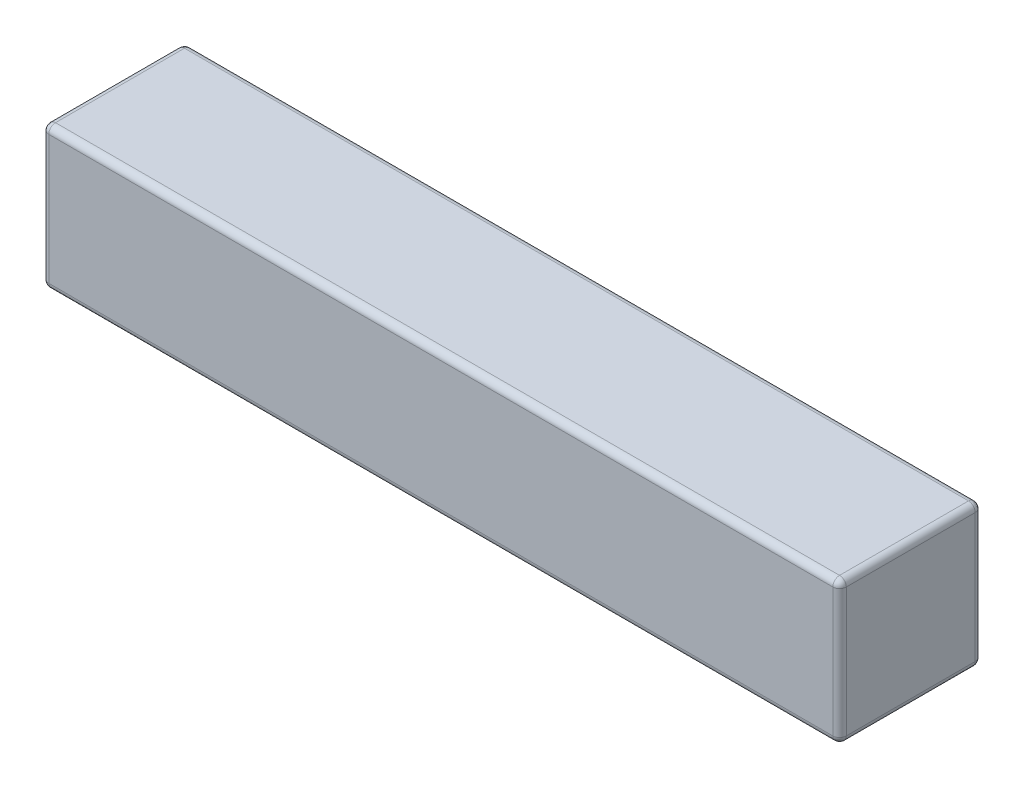
ISO-10303-21;
HEADER;
FILE_DESCRIPTION(('STEP AP214'),'2;1');
FILE_NAME('part.step','',(''),(''),'','','');
FILE_SCHEMA(('AUTOMOTIVE_DESIGN { 1 0 10303 214 1 1 1 1 }'));
ENDSEC;
DATA;
#1=APPLICATION_CONTEXT('core data for automotive mechanical design processes');
#2=APPLICATION_PROTOCOL_DEFINITION('international standard','automotive_design',2000,#1);
#3=PRODUCT_CONTEXT('',#1,'mechanical');
#4=PRODUCT('Part','Part','',(#3));
#5=PRODUCT_RELATED_PRODUCT_CATEGORY('part','',(#4));
#6=PRODUCT_DEFINITION_FORMATION('','',#4);
#7=PRODUCT_DEFINITION_CONTEXT('part definition',#1,'design');
#8=PRODUCT_DEFINITION('design','',#6,#7);
#9=PRODUCT_DEFINITION_SHAPE('','',#8);
#10=(LENGTH_UNIT() NAMED_UNIT(*) SI_UNIT(.MILLI.,.METRE.));
#11=(NAMED_UNIT(*) PLANE_ANGLE_UNIT() SI_UNIT($,.RADIAN.));
#12=(NAMED_UNIT(*) SI_UNIT($,.STERADIAN.) SOLID_ANGLE_UNIT());
#13=UNCERTAINTY_MEASURE_WITH_UNIT(LENGTH_MEASURE(1.E-05),#10,'distance_accuracy_value','');
#14=(GEOMETRIC_REPRESENTATION_CONTEXT(3) GLOBAL_UNCERTAINTY_ASSIGNED_CONTEXT((#13)) GLOBAL_UNIT_ASSIGNED_CONTEXT((#10,
#11,#12)) REPRESENTATION_CONTEXT('',''));
#15=CARTESIAN_POINT('',(0.,0.,0.));
#16=DIRECTION('',(0.,0.,1.));
#17=DIRECTION('',(1.,0.,0.));
#18=AXIS2_PLACEMENT_3D('',#15,#16,#17);
#19=CARTESIAN_POINT('',(13.8499999987,-3.1750000002794,-0.37923963141));
#20=CARTESIAN_POINT('',(13.8499999987,-3.1750000002794,-0.0792396314111998));
#21=CARTESIAN_POINT('',(13.8499999987,-2.8750000002806,-0.0792396314111998));
#22=CARTESIAN_POINT('',(13.8499999987,-2.8750000002806,-0.37923963141));
#23=(BOUNDED_CURVE() B_SPLINE_CURVE(3,(#19,#20,#21,#22),.UNSPECIFIED.,.F.,
.F.) B_SPLINE_CURVE_WITH_KNOTS((4,4),(0.,1.),
.UNSPECIFIED.) CURVE() GEOMETRIC_REPRESENTATION_ITEM() RATIONAL_B_SPLINE_CURVE((1.,
0.333333333333333,0.333333333333333,1.)) REPRESENTATION_ITEM(''));
#24=CARTESIAN_POINT('',(13.8499999987,-3.02500000028,-0.37923963141));
#25=DIRECTION('',(0.,1.,0.));
#26=AXIS1_PLACEMENT('',#24,#25);
#27=SURFACE_OF_REVOLUTION('',#23,#26);
#28=CARTESIAN_POINT('',(13.85000000124,-3.02500000028,-0.37923963141));
#29=DIRECTION('',(-1.,0.,0.));
#30=DIRECTION('',(0.,-1.,0.));
#31=AXIS2_PLACEMENT_3D('',#28,#29,#30);
#32=CIRCLE('',#31,0.149999999719999);
#33=CARTESIAN_POINT('',(13.8499999996525,-3.02500000028,-0.229239631460499));
#34=VERTEX_POINT('',#33);
#35=CARTESIAN_POINT('',(13.8499999996525,-3.17500000009938,-0.3792396314735));
#36=VERTEX_POINT('',#35);
#37=EDGE_CURVE('E316',#34,#36,#32,.F.);
#38=ORIENTED_EDGE('',*,*,#37,.T.);
#39=CARTESIAN_POINT('',(13.8499999987,-3.02500000028,-0.379239631664));
#40=DIRECTION('',(0.,0.,1.));
#41=DIRECTION('',(0.,-1.,0.));
#42=AXIS2_PLACEMENT_3D('',#39,#40,#41);
#43=CIRCLE('',#42,0.149999999719999);
#44=CARTESIAN_POINT('',(13.9999999990277,-3.02500000028,-0.37923963163225));
#45=VERTEX_POINT('',#44);
#46=EDGE_CURVE('E373',#36,#45,#43,.T.);
#47=ORIENTED_EDGE('',*,*,#46,.T.);
#48=CARTESIAN_POINT('',(13.8499999987,-3.02500000028,-0.37923963141));
#49=DIRECTION('',(0.,1.,0.));
#50=DIRECTION('',(0.,0.,1.));
#51=AXIS2_PLACEMENT_3D('',#48,#49,#50);
#52=CIRCLE('',#51,0.1500000000756);
#53=EDGE_CURVE('E141',#45,#34,#52,.F.);
#54=ORIENTED_EDGE('',*,*,#53,.T.);
#55=EDGE_LOOP('',(#38,#47,#54));
#56=FACE_BOUND('',#55,.T.);
#57=ADVANCED_FACE('F17',(#56),#27,.T.);
#58=CARTESIAN_POINT('',(13.8499999987,-3.1750000002794,-3.2542396307));
#59=CARTESIAN_POINT('',(14.1499999986988,-3.1750000002794,-3.2542396307));
#60=CARTESIAN_POINT('',(14.1499999986988,-2.8750000002806,-3.2542396307));
#61=CARTESIAN_POINT('',(13.8499999987,-2.8750000002806,-3.2542396307));
#62=(BOUNDED_CURVE() B_SPLINE_CURVE(3,(#58,#59,#60,#61),.UNSPECIFIED.,.F.,
.F.) B_SPLINE_CURVE_WITH_KNOTS((4,4),(0.,1.),
.UNSPECIFIED.) CURVE() GEOMETRIC_REPRESENTATION_ITEM() RATIONAL_B_SPLINE_CURVE((1.,
0.333333333333333,0.333333333333333,1.)) REPRESENTATION_ITEM(''));
#63=CARTESIAN_POINT('',(13.8499999987,-3.02500000028,-3.2542396307));
#64=DIRECTION('',(0.,1.,0.));
#65=AXIS1_PLACEMENT('',#63,#64);
#66=SURFACE_OF_REVOLUTION('',#62,#65);
#67=CARTESIAN_POINT('',(13.8499999987,-3.02500000028,-3.2542396307));
#68=DIRECTION('',(1.,0.,0.));
#69=DIRECTION('',(0.,-1.,0.));
#70=AXIS2_PLACEMENT_3D('',#67,#68,#69);
#71=CIRCLE('',#70,0.149999999719999);
#72=CARTESIAN_POINT('',(13.8499999990175,-3.17500000009938,-3.2542396307));
#73=VERTEX_POINT('',#72);
#74=CARTESIAN_POINT('',(13.8499999987,-3.02500000028,-3.40423963101479));
#75=VERTEX_POINT('',#74);
#76=EDGE_CURVE('E378',#73,#75,#71,.T.);
#77=ORIENTED_EDGE('',*,*,#76,.T.);
#78=CARTESIAN_POINT('',(13.8499999987,-3.02500000028,-3.2542396307));
#79=DIRECTION('',(0.,1.,0.));
#80=DIRECTION('',(1.,0.,0.));
#81=AXIS2_PLACEMENT_3D('',#78,#79,#80);
#82=CIRCLE('',#81,0.15000000226);
#83=CARTESIAN_POINT('',(13.9999999991674,-3.02500000028,-3.2542396307));
#84=VERTEX_POINT('',#83);
#85=EDGE_CURVE('E383',#75,#84,#82,.F.);
#86=ORIENTED_EDGE('',*,*,#85,.T.);
#87=CARTESIAN_POINT('',(13.8499999987,-3.02500000028,-3.2542396307));
#88=DIRECTION('',(0.,0.,1.));
#89=DIRECTION('',(0.,-1.,0.));
#90=AXIS2_PLACEMENT_3D('',#87,#88,#89);
#91=CIRCLE('',#90,0.149999999719999);
#92=EDGE_CURVE('E371',#84,#73,#91,.F.);
#93=ORIENTED_EDGE('',*,*,#92,.T.);
#94=EDGE_LOOP('',(#77,#86,#93));
#95=FACE_BOUND('',#94,.T.);
#96=ADVANCED_FACE('F166',(#95),#66,.T.);
#97=CARTESIAN_POINT('',(13.9999999986994,-0.1499999999994,-3.2542396307));
#98=CARTESIAN_POINT('',(13.9999999986994,0.149999999999398,-3.2542396307));
#99=CARTESIAN_POINT('',(13.6999999987006,0.149999999999398,-3.2542396307));
#100=CARTESIAN_POINT('',(13.6999999987006,-0.1499999999994,-3.2542396307));
#101=(BOUNDED_CURVE() B_SPLINE_CURVE(3,(#97,#98,#99,#100),.UNSPECIFIED.,.F.,
.F.) B_SPLINE_CURVE_WITH_KNOTS((4,4),(0.,1.),
.UNSPECIFIED.) CURVE() GEOMETRIC_REPRESENTATION_ITEM() RATIONAL_B_SPLINE_CURVE((1.,
0.333333333333333,0.333333333333333,1.)) REPRESENTATION_ITEM(''));
#102=CARTESIAN_POINT('',(13.8499999987,-0.1499999999994,-3.2542396307));
#103=DIRECTION('',(-1.,0.,0.));
#104=AXIS1_PLACEMENT('',#102,#103);
#105=SURFACE_OF_REVOLUTION('',#101,#104);
#106=CARTESIAN_POINT('',(13.8499999987,-0.1499999996184,-3.2542396307));
#107=DIRECTION('',(0.,1.,0.));
#108=DIRECTION('',(1.,0.,0.));
#109=AXIS2_PLACEMENT_3D('',#106,#107,#108);
#110=CIRCLE('',#109,0.15000000226);
#111=CARTESIAN_POINT('',(13.9999999999923,-0.14999999971365,-3.2542396307));
#112=VERTEX_POINT('',#111);
#113=CARTESIAN_POINT('',(13.8499999990175,-0.1499999998089,-3.40423963136722));
#114=VERTEX_POINT('',#113);
#115=EDGE_CURVE('E381',#112,#114,#110,.T.);
#116=ORIENTED_EDGE('',*,*,#115,.T.);
#117=CARTESIAN_POINT('',(13.85000000124,-0.1499999999994,-3.2542396307));
#118=DIRECTION('',(-1.,0.,0.));
#119=DIRECTION('',(0.,1.,0.));
#120=AXIS2_PLACEMENT_3D('',#117,#118,#119);
#121=CIRCLE('',#120,0.1499999999994);
#122=CARTESIAN_POINT('',(13.8499999996525,0.,-3.2542396307));
#123=VERTEX_POINT('',#122);
#124=EDGE_CURVE('E389',#114,#123,#121,.F.);
#125=ORIENTED_EDGE('',*,*,#124,.T.);
#126=CARTESIAN_POINT('',(13.8499999987,-0.1499999999994,-3.2542396307));
#127=DIRECTION('',(0.,0.,-1.));
#128=DIRECTION('',(0.,1.,0.));
#129=AXIS2_PLACEMENT_3D('',#126,#127,#128);
#130=CIRCLE('',#129,0.1499999999994);
#131=EDGE_CURVE('E137',#123,#112,#130,.T.);
#132=ORIENTED_EDGE('',*,*,#131,.T.);
#133=EDGE_LOOP('',(#116,#125,#132));
#134=FACE_BOUND('',#133,.T.);
#135=ADVANCED_FACE('F164',(#134),#105,.T.);
#136=CARTESIAN_POINT('',(14.,0.,0.));
#137=DIRECTION('',(1.,0.,0.));
#138=DIRECTION('',(0.,0.,-1.));
#139=AXIS2_PLACEMENT_3D('',#136,#137,#138);
#140=PLANE('',#139);
#141=DIRECTION('',(0.,1.,0.));
#142=VECTOR('',#141,1.);
#143=CARTESIAN_POINT('',(14.00000000096,-1.5874999999492,-3.2542396307));
#144=LINE('',#143,#142);
#145=EDGE_CURVE('E136',#84,#112,#144,.T.);
#146=ORIENTED_EDGE('',*,*,#145,.T.);
#147=DIRECTION('',(0.,0.,1.));
#148=VECTOR('',#147,1.);
#149=CARTESIAN_POINT('',(13.9999999986994,-0.1499999996184,-1.816739631055));
#150=LINE('',#149,#148);
#151=CARTESIAN_POINT('',(13.9999999990627,-0.149999999666025,-0.3792396316005));
#152=VERTEX_POINT('',#151);
#153=EDGE_CURVE('E127',#112,#152,#150,.T.);
#154=ORIENTED_EDGE('',*,*,#153,.T.);
#155=DIRECTION('',(0.,-1.,0.));
#156=VECTOR('',#155,1.);
#157=CARTESIAN_POINT('',(13.9999999987756,-1.5874999999492,-0.379239631664001));
#158=LINE('',#157,#156);
#159=EDGE_CURVE('E106',#152,#45,#158,.T.);
#160=ORIENTED_EDGE('',*,*,#159,.T.);
#161=DIRECTION('',(0.,0.,-1.));
#162=VECTOR('',#161,1.);
#163=CARTESIAN_POINT('',(13.99999999842,-3.02500000028,-1.816739631182));
#164=LINE('',#163,#162);
#165=EDGE_CURVE('E367',#45,#84,#164,.T.);
#166=ORIENTED_EDGE('',*,*,#165,.T.);
#167=EDGE_LOOP('',(#146,#154,#160,#166));
#168=FACE_BOUND('',#167,.T.);
#169=ADVANCED_FACE('F134',(#168),#140,.T.);
#170=CARTESIAN_POINT('',(13.8499999987,-0.1499999999994,-0.2292396314106));
#171=CARTESIAN_POINT('',(13.8499999987,0.1499999999994,-0.2292396314106));
#172=CARTESIAN_POINT('',(13.8499999987,0.1499999999994,-0.5292396314094));
#173=CARTESIAN_POINT('',(13.8499999987,-0.1499999999994,-0.5292396314094));
#174=(BOUNDED_CURVE() B_SPLINE_CURVE(3,(#170,#171,#172,#173),.UNSPECIFIED.,.F.,
.F.) B_SPLINE_CURVE_WITH_KNOTS((4,4),(0.,1.),
.UNSPECIFIED.) CURVE() GEOMETRIC_REPRESENTATION_ITEM() RATIONAL_B_SPLINE_CURVE((1.,
0.333333333333333,0.333333333333333,1.)) REPRESENTATION_ITEM(''));
#175=CARTESIAN_POINT('',(13.8499999987,-0.1499999999994,-0.37923963141));
#176=DIRECTION('',(0.,0.,-1.));
#177=AXIS1_PLACEMENT('',#175,#176);
#178=SURFACE_OF_REVOLUTION('',#174,#177);
#179=CARTESIAN_POINT('',(13.8499999987,-0.1499999996184,-0.37923963141));
#180=DIRECTION('',(0.,1.,0.));
#181=DIRECTION('',(0.,0.,1.));
#182=AXIS2_PLACEMENT_3D('',#179,#180,#181);
#183=CIRCLE('',#182,0.1500000000756);
#184=CARTESIAN_POINT('',(13.8499999996525,-0.1499999998089,-0.229239631390649));
#185=VERTEX_POINT('',#184);
#186=EDGE_CURVE('E111',#185,#152,#183,.T.);
#187=ORIENTED_EDGE('',*,*,#186,.T.);
#188=CARTESIAN_POINT('',(13.8499999987,-0.1499999999994,-0.37923963141));
#189=DIRECTION('',(0.,0.,-1.));
#190=DIRECTION('',(0.,1.,0.));
#191=AXIS2_PLACEMENT_3D('',#188,#189,#190);
#192=CIRCLE('',#191,0.1499999999994);
#193=CARTESIAN_POINT('',(13.8499999996525,0.,-0.37923963144175));
#194=VERTEX_POINT('',#193);
#195=EDGE_CURVE('E114',#152,#194,#192,.F.);
#196=ORIENTED_EDGE('',*,*,#195,.T.);
#197=CARTESIAN_POINT('',(13.85000000124,-0.1499999999994,-0.37923963141));
#198=DIRECTION('',(1.,0.,0.));
#199=DIRECTION('',(0.,1.,0.));
#200=AXIS2_PLACEMENT_3D('',#197,#198,#199);
#201=CIRCLE('',#200,0.1499999999994);
#202=EDGE_CURVE('E116',#194,#185,#201,.T.);
#203=ORIENTED_EDGE('',*,*,#202,.T.);
#204=EDGE_LOOP('',(#187,#196,#203));
#205=FACE_BOUND('',#204,.T.);
#206=ADVANCED_FACE('F113',(#205),#178,.T.);
#207=CARTESIAN_POINT('',(13.8499999987,-3.02500000028,-0.37923963141));
#208=DIRECTION('',(0.,1.,0.));
#209=DIRECTION('',(0.,0.,1.));
#210=AXIS2_PLACEMENT_3D('',#207,#208,#209);
#211=CYLINDRICAL_SURFACE('',#210,0.1500000000756);
#212=ORIENTED_EDGE('',*,*,#159,.F.);
#213=ORIENTED_EDGE('',*,*,#186,.F.);
#214=DIRECTION('',(0.,1.,0.));
#215=VECTOR('',#214,1.);
#216=CARTESIAN_POINT('',(13.85000000124,0.,-0.229239631327189));
#217=LINE('',#216,#215);
#218=EDGE_CURVE('E393',#185,#34,#217,.F.);
#219=ORIENTED_EDGE('',*,*,#218,.T.);
#220=ORIENTED_EDGE('',*,*,#53,.F.);
#221=EDGE_LOOP('',(#212,#213,#219,#220));
#222=FACE_BOUND('',#221,.T.);
#223=ADVANCED_FACE('F140',(#222),#211,.T.);
#224=CARTESIAN_POINT('',(13.85000000124,-3.02500000028,-0.37923963141));
#225=DIRECTION('',(-1.,0.,0.));
#226=DIRECTION('',(0.,0.,1.));
#227=AXIS2_PLACEMENT_3D('',#224,#225,#226);
#228=CYLINDRICAL_SURFACE('',#227,0.149999999719999);
#229=DIRECTION('',(1.,0.,0.));
#230=VECTOR('',#229,1.);
#231=CARTESIAN_POINT('',(0.,-3.02500000028,-0.229239631327189));
#232=LINE('',#231,#230);
#233=CARTESIAN_POINT('',(-3.62999999932,-3.02500000028,-0.229239631564373));
#234=VERTEX_POINT('',#233);
#235=EDGE_CURVE('E132',#34,#234,#232,.F.);
#236=ORIENTED_EDGE('',*,*,#235,.T.);
#237=CARTESIAN_POINT('',(-3.62999999932,-3.02500000028,-0.37923963141));
#238=DIRECTION('',(-1.,0.,0.));
#239=DIRECTION('',(0.,-1.,0.));
#240=AXIS2_PLACEMENT_3D('',#237,#238,#239);
#241=CIRCLE('',#240,0.149999999719999);
#242=CARTESIAN_POINT('',(-3.62999999932,-3.17499999995428,-0.37923963141));
#243=VERTEX_POINT('',#242);
#244=EDGE_CURVE('E143',#243,#234,#241,.T.);
#245=ORIENTED_EDGE('',*,*,#244,.F.);
#246=DIRECTION('',(1.,0.,0.));
#247=VECTOR('',#246,1.);
#248=CARTESIAN_POINT('',(0.,-3.17499999967742,-0.379239631664));
#249=LINE('',#248,#247);
#250=EDGE_CURVE('E395',#243,#36,#249,.T.);
#251=ORIENTED_EDGE('',*,*,#250,.T.);
#252=ORIENTED_EDGE('',*,*,#37,.F.);
#253=EDGE_LOOP('',(#236,#245,#251,#252));
#254=FACE_BOUND('',#253,.T.);
#255=ADVANCED_FACE('F303',(#254),#228,.T.);
#256=CARTESIAN_POINT('',(13.8499999987,-3.02500000028,-3.2542396307));
#257=DIRECTION('',(0.,0.,1.));
#258=DIRECTION('',(1.,0.,0.));
#259=AXIS2_PLACEMENT_3D('',#256,#257,#258);
#260=CYLINDRICAL_SURFACE('',#259,0.149999999719999);
#261=DIRECTION('',(0.,0.,1.));
#262=VECTOR('',#261,1.);
#263=CARTESIAN_POINT('',(13.85000000124,-3.17499999967742,0.));
#264=LINE('',#263,#262);
#265=EDGE_CURVE('E396',#36,#73,#264,.F.);
#266=ORIENTED_EDGE('',*,*,#265,.T.);
#267=ORIENTED_EDGE('',*,*,#92,.F.);
#268=ORIENTED_EDGE('',*,*,#165,.F.);
#269=ORIENTED_EDGE('',*,*,#46,.F.);
#270=EDGE_LOOP('',(#266,#267,#268,#269));
#271=FACE_BOUND('',#270,.T.);
#272=ADVANCED_FACE('F300',(#271),#260,.T.);
#273=CARTESIAN_POINT('',(-3.63000000186,-3.02500000028,-3.2542396307));
#274=DIRECTION('',(1.,0.,0.));
#275=DIRECTION('',(0.,0.,-1.));
#276=AXIS2_PLACEMENT_3D('',#273,#274,#275);
#277=CYLINDRICAL_SURFACE('',#276,0.149999999719999);
#278=DIRECTION('',(1.,0.,0.));
#279=VECTOR('',#278,1.);
#280=CARTESIAN_POINT('',(0.,-3.17499999967742,-3.2542396307));
#281=LINE('',#280,#279);
#282=CARTESIAN_POINT('',(-3.63000000059,-3.17499999995428,-3.2542396307));
#283=VERTEX_POINT('',#282);
#284=EDGE_CURVE('E262',#73,#283,#281,.F.);
#285=ORIENTED_EDGE('',*,*,#284,.T.);
#286=CARTESIAN_POINT('',(-3.63000000186,-3.02500000028,-3.2542396307));
#287=DIRECTION('',(1.,0.,0.));
#288=DIRECTION('',(0.,-1.,0.));
#289=AXIS2_PLACEMENT_3D('',#286,#287,#288);
#290=CIRCLE('',#289,0.149999999719999);
#291=CARTESIAN_POINT('',(-3.630000001225,-3.02500000028,-3.40423963073011));
#292=VERTEX_POINT('',#291);
#293=EDGE_CURVE('E376',#292,#283,#290,.F.);
#294=ORIENTED_EDGE('',*,*,#293,.F.);
#295=DIRECTION('',(-1.,0.,0.));
#296=VECTOR('',#295,1.);
#297=CARTESIAN_POINT('',(0.,-3.02500000028,-3.40423963152074));
#298=LINE('',#297,#296);
#299=EDGE_CURVE('E259',#292,#75,#298,.F.);
#300=ORIENTED_EDGE('',*,*,#299,.T.);
#301=ORIENTED_EDGE('',*,*,#76,.F.);
#302=EDGE_LOOP('',(#285,#294,#300,#301));
#303=FACE_BOUND('',#302,.T.);
#304=ADVANCED_FACE('F296',(#303),#277,.T.);
#305=CARTESIAN_POINT('',(13.8499999987,-3.02500000028,-3.2542396307));
#306=DIRECTION('',(0.,1.,0.));
#307=DIRECTION('',(0.,0.,1.));
#308=AXIS2_PLACEMENT_3D('',#305,#306,#307);
#309=CYLINDRICAL_SURFACE('',#308,0.15000000226);
#310=DIRECTION('',(0.,1.,0.));
#311=VECTOR('',#310,1.);
#312=CARTESIAN_POINT('',(13.8499999987,0.,-3.40423963152074));
#313=LINE('',#312,#311);
#314=EDGE_CURVE('E256',#75,#114,#313,.T.);
#315=ORIENTED_EDGE('',*,*,#314,.T.);
#316=ORIENTED_EDGE('',*,*,#115,.F.);
#317=ORIENTED_EDGE('',*,*,#145,.F.);
#318=ORIENTED_EDGE('',*,*,#85,.F.);
#319=EDGE_LOOP('',(#315,#316,#317,#318));
#320=FACE_BOUND('',#319,.T.);
#321=ADVANCED_FACE('F292',(#320),#309,.T.);
#322=CARTESIAN_POINT('',(-3.62999999932,-0.1499999999994,-0.37923963141));
#323=DIRECTION('',(1.,0.,0.));
#324=DIRECTION('',(0.,0.,-1.));
#325=AXIS2_PLACEMENT_3D('',#322,#323,#324);
#326=CYLINDRICAL_SURFACE('',#325,0.1499999999994);
#327=DIRECTION('',(1.,0.,0.));
#328=VECTOR('',#327,1.);
#329=CARTESIAN_POINT('',(0.,-0.1499999996184,-0.229239631327189));
#330=LINE('',#329,#328);
#331=CARTESIAN_POINT('',(-3.62999999932,-0.14999999971365,-0.229239631435099));
#332=VERTEX_POINT('',#331);
#333=EDGE_CURVE('E317',#332,#185,#330,.T.);
#334=ORIENTED_EDGE('',*,*,#333,.T.);
#335=ORIENTED_EDGE('',*,*,#202,.F.);
#336=DIRECTION('',(1.,0.,0.));
#337=VECTOR('',#336,1.);
#338=CARTESIAN_POINT('',(0.,0.,-0.379239631664));
#339=LINE('',#338,#337);
#340=CARTESIAN_POINT('',(-3.62999999932,0.,-0.37923963150525));
#341=VERTEX_POINT('',#340);
#342=EDGE_CURVE('E226',#194,#341,#339,.F.);
#343=ORIENTED_EDGE('',*,*,#342,.T.);
#344=CARTESIAN_POINT('',(-3.62999999932,-0.1499999999994,-0.37923963141));
#345=DIRECTION('',(1.,0.,0.));
#346=DIRECTION('',(0.,1.,0.));
#347=AXIS2_PLACEMENT_3D('',#344,#345,#346);
#348=CIRCLE('',#347,0.1499999999994);
#349=EDGE_CURVE('E387',#332,#341,#348,.F.);
#350=ORIENTED_EDGE('',*,*,#349,.F.);
#351=EDGE_LOOP('',(#334,#335,#343,#350));
#352=FACE_BOUND('',#351,.T.);
#353=ADVANCED_FACE('F288',(#352),#326,.T.);
#354=CARTESIAN_POINT('',(13.85000000124,-0.1499999999994,-3.2542396307));
#355=DIRECTION('',(-1.,0.,0.));
#356=DIRECTION('',(0.,0.,1.));
#357=AXIS2_PLACEMENT_3D('',#354,#355,#356);
#358=CYLINDRICAL_SURFACE('',#357,0.1499999999994);
#359=DIRECTION('',(-1.,0.,0.));
#360=VECTOR('',#359,1.);
#361=CARTESIAN_POINT('',(0.,-0.1499999996184,-3.40423963152074));
#362=LINE('',#361,#360);
#363=CARTESIAN_POINT('',(-3.629999999955,-0.14999999971365,-3.40423963086981));
#364=VERTEX_POINT('',#363);
#365=EDGE_CURVE('E251',#114,#364,#362,.T.);
#366=ORIENTED_EDGE('',*,*,#365,.T.);
#367=CARTESIAN_POINT('',(-3.62999999932,-0.1499999999994,-3.2542396307));
#368=DIRECTION('',(1.,0.,0.));
#369=DIRECTION('',(0.,0.,-1.));
#370=AXIS2_PLACEMENT_3D('',#367,#368,#369);
#371=CIRCLE('',#370,0.1499999999994);
#372=CARTESIAN_POINT('',(-3.62999999932,0.,-3.2542396307));
#373=VERTEX_POINT('',#372);
#374=EDGE_CURVE('E229',#364,#373,#371,.T.);
#375=ORIENTED_EDGE('',*,*,#374,.T.);
#376=DIRECTION('',(1.,0.,0.));
#377=VECTOR('',#376,1.);
#378=CARTESIAN_POINT('',(0.,0.,-3.2542396307));
#379=LINE('',#378,#377);
#380=EDGE_CURVE('E223',#373,#123,#379,.T.);
#381=ORIENTED_EDGE('',*,*,#380,.T.);
#382=ORIENTED_EDGE('',*,*,#124,.F.);
#383=EDGE_LOOP('',(#366,#375,#381,#382));
#384=FACE_BOUND('',#383,.T.);
#385=ADVANCED_FACE('F285',(#384),#358,.T.);
#386=CARTESIAN_POINT('',(13.8499999987,-0.1499999999994,-0.37923963141));
#387=DIRECTION('',(0.,0.,-1.));
#388=DIRECTION('',(-1.,0.,0.));
#389=AXIS2_PLACEMENT_3D('',#386,#387,#388);
#390=CYLINDRICAL_SURFACE('',#389,0.1499999999994);
#391=ORIENTED_EDGE('',*,*,#153,.F.);
#392=ORIENTED_EDGE('',*,*,#131,.F.);
#393=DIRECTION('',(0.,0.,1.));
#394=VECTOR('',#393,1.);
#395=CARTESIAN_POINT('',(13.85000000124,0.,0.));
#396=LINE('',#395,#394);
#397=EDGE_CURVE('E130',#123,#194,#396,.T.);
#398=ORIENTED_EDGE('',*,*,#397,.T.);
#399=ORIENTED_EDGE('',*,*,#195,.F.);
#400=EDGE_LOOP('',(#391,#392,#398,#399));
#401=FACE_BOUND('',#400,.T.);
#402=ADVANCED_FACE('F125',(#401),#390,.T.);
#403=CARTESIAN_POINT('',(0.,0.,-0.229239631327189));
#404=DIRECTION('',(0.,0.,1.));
#405=DIRECTION('',(1.,0.,0.));
#406=AXIS2_PLACEMENT_3D('',#403,#404,#405);
#407=PLANE('',#406);
#408=ORIENTED_EDGE('',*,*,#333,.F.);
#409=DIRECTION('',(0.,-1.,0.));
#410=VECTOR('',#409,1.);
#411=CARTESIAN_POINT('',(-3.62999999932,-1.5874999999492,-0.229239631690002));
#412=LINE('',#411,#410);
#413=EDGE_CURVE('E321',#332,#234,#412,.T.);
#414=ORIENTED_EDGE('',*,*,#413,.T.);
#415=ORIENTED_EDGE('',*,*,#235,.F.);
#416=ORIENTED_EDGE('',*,*,#218,.F.);
#417=EDGE_LOOP('',(#408,#414,#415,#416));
#418=FACE_BOUND('',#417,.T.);
#419=ADVANCED_FACE('F278',(#418),#407,.T.);
#420=CARTESIAN_POINT('',(0.,-3.17499999967742,0.));
#421=DIRECTION('',(0.,1.,0.));
#422=DIRECTION('',(0.,0.,1.));
#423=AXIS2_PLACEMENT_3D('',#420,#421,#422);
#424=PLANE('',#423);
#425=ORIENTED_EDGE('',*,*,#284,.F.);
#426=ORIENTED_EDGE('',*,*,#265,.F.);
#427=ORIENTED_EDGE('',*,*,#250,.F.);
#428=DIRECTION('',(0.,0.,-1.));
#429=VECTOR('',#428,1.);
#430=CARTESIAN_POINT('',(-3.62999999932,-3.175,-1.816739630801));
#431=LINE('',#430,#429);
#432=EDGE_CURVE('E330',#243,#283,#431,.T.);
#433=ORIENTED_EDGE('',*,*,#432,.T.);
#434=EDGE_LOOP('',(#425,#426,#427,#433));
#435=FACE_BOUND('',#434,.T.);
#436=ADVANCED_FACE('F274',(#435),#424,.F.);
#437=CARTESIAN_POINT('',(-3.62999999932,-3.1750000002794,-0.37923963141));
#438=CARTESIAN_POINT('',(-3.9299999993188,-3.1750000002794,-0.37923963141));
#439=CARTESIAN_POINT('',(-3.9299999993188,-2.8750000002806,-0.37923963141));
#440=CARTESIAN_POINT('',(-3.62999999932,-2.8750000002806,-0.37923963141));
#441=(BOUNDED_CURVE() B_SPLINE_CURVE(3,(#437,#438,#439,#440),.UNSPECIFIED.,.F.,
.F.) B_SPLINE_CURVE_WITH_KNOTS((4,4),(0.,1.),
.UNSPECIFIED.) CURVE() GEOMETRIC_REPRESENTATION_ITEM() RATIONAL_B_SPLINE_CURVE((1.,
0.333333333333333,0.333333333333333,1.)) REPRESENTATION_ITEM(''));
#442=CARTESIAN_POINT('',(-3.62999999932,-3.02500000028,-0.37923963141));
#443=DIRECTION('',(0.,1.,0.));
#444=AXIS1_PLACEMENT('',#442,#443);
#445=SURFACE_OF_REVOLUTION('',#441,#444);
#446=ORIENTED_EDGE('',*,*,#244,.T.);
#447=CARTESIAN_POINT('',(-3.62999999932,-3.02500000028,-0.37923963141));
#448=DIRECTION('',(0.,1.,0.));
#449=DIRECTION('',(-1.,0.,0.));
#450=AXIS2_PLACEMENT_3D('',#447,#448,#449);
#451=CIRCLE('',#450,0.149999999719999);
#452=CARTESIAN_POINT('',(-3.7799999992997,-3.02500000028,-0.379239631283));
#453=VERTEX_POINT('',#452);
#454=EDGE_CURVE('E324',#234,#453,#451,.F.);
#455=ORIENTED_EDGE('',*,*,#454,.T.);
#456=CARTESIAN_POINT('',(-3.62999999932,-3.02500000028,-0.379239630902));
#457=DIRECTION('',(0.,0.,-1.));
#458=DIRECTION('',(0.,-1.,0.));
#459=AXIS2_PLACEMENT_3D('',#456,#457,#458);
#460=CIRCLE('',#459,0.149999999719999);
#461=EDGE_CURVE('E337',#453,#243,#460,.F.);
#462=ORIENTED_EDGE('',*,*,#461,.T.);
#463=EDGE_LOOP('',(#446,#455,#462));
#464=FACE_BOUND('',#463,.T.);
#465=ADVANCED_FACE('F271',(#464),#445,.T.);
#466=CARTESIAN_POINT('',(0.,0.,-3.40423963152074));
#467=DIRECTION('',(0.,0.,-1.));
#468=DIRECTION('',(-1.,0.,0.));
#469=AXIS2_PLACEMENT_3D('',#466,#467,#468);
#470=PLANE('',#469);
#471=ORIENTED_EDGE('',*,*,#365,.F.);
#472=ORIENTED_EDGE('',*,*,#314,.F.);
#473=ORIENTED_EDGE('',*,*,#299,.F.);
#474=DIRECTION('',(0.,1.,0.));
#475=VECTOR('',#474,1.);
#476=CARTESIAN_POINT('',(-3.62999999932,-1.5874999999492,-3.40423963042));
#477=LINE('',#476,#475);
#478=EDGE_CURVE('E339',#292,#364,#477,.T.);
#479=ORIENTED_EDGE('',*,*,#478,.T.);
#480=EDGE_LOOP('',(#471,#472,#473,#479));
#481=FACE_BOUND('',#480,.T.);
#482=ADVANCED_FACE('F244',(#481),#470,.T.);
#483=CARTESIAN_POINT('',(-3.62999999932,-3.1750000002794,-3.2542396307));
#484=CARTESIAN_POINT('',(-3.62999999932,-3.1750000002794,-3.5542396306988));
#485=CARTESIAN_POINT('',(-3.62999999932,-2.8750000002806,-3.5542396306988));
#486=CARTESIAN_POINT('',(-3.62999999932,-2.8750000002806,-3.2542396307));
#487=(BOUNDED_CURVE() B_SPLINE_CURVE(3,(#483,#484,#485,#486),.UNSPECIFIED.,.F.,
.F.) B_SPLINE_CURVE_WITH_KNOTS((4,4),(0.,1.),
.UNSPECIFIED.) CURVE() GEOMETRIC_REPRESENTATION_ITEM() RATIONAL_B_SPLINE_CURVE((1.,
0.333333333333333,0.333333333333333,1.)) REPRESENTATION_ITEM(''));
#488=CARTESIAN_POINT('',(-3.62999999932,-3.02500000028,-3.2542396307));
#489=DIRECTION('',(0.,1.,0.));
#490=AXIS1_PLACEMENT('',#488,#489);
#491=SURFACE_OF_REVOLUTION('',#487,#490);
#492=CARTESIAN_POINT('',(-3.62999999932,-3.02500000028,-3.2542396307));
#493=DIRECTION('',(0.,0.,-1.));
#494=DIRECTION('',(0.,-1.,0.));
#495=AXIS2_PLACEMENT_3D('',#492,#493,#494);
#496=CIRCLE('',#495,0.149999999719999);
#497=CARTESIAN_POINT('',(-3.7799999992997,-3.02500000028,-3.2542396307));
#498=VERTEX_POINT('',#497);
#499=EDGE_CURVE('E333',#283,#498,#496,.T.);
#500=ORIENTED_EDGE('',*,*,#499,.T.);
#501=CARTESIAN_POINT('',(-3.62999999932,-3.02500000028,-3.2542396307));
#502=DIRECTION('',(0.,1.,0.));
#503=DIRECTION('',(0.,0.,-1.));
#504=AXIS2_PLACEMENT_3D('',#501,#502,#503);
#505=CIRCLE('',#504,0.14999999972);
#506=EDGE_CURVE('E343',#498,#292,#505,.F.);
#507=ORIENTED_EDGE('',*,*,#506,.T.);
#508=ORIENTED_EDGE('',*,*,#293,.T.);
#509=EDGE_LOOP('',(#500,#507,#508));
#510=FACE_BOUND('',#509,.T.);
#511=ADVANCED_FACE('F241',(#510),#491,.T.);
#512=CARTESIAN_POINT('',(-3.62999999932,-0.1499999999994,-3.4042396306994));
#513=CARTESIAN_POINT('',(-3.62999999932,0.149999999999399,-3.4042396306994));
#514=CARTESIAN_POINT('',(-3.62999999932,0.149999999999399,-3.1042396307006));
#515=CARTESIAN_POINT('',(-3.62999999932,-0.1499999999994,-3.1042396307006));
#516=(BOUNDED_CURVE() B_SPLINE_CURVE(3,(#512,#513,#514,#515),.UNSPECIFIED.,.F.,
.F.) B_SPLINE_CURVE_WITH_KNOTS((4,4),(0.,1.),
.UNSPECIFIED.) CURVE() GEOMETRIC_REPRESENTATION_ITEM() RATIONAL_B_SPLINE_CURVE((1.,
0.333333333333333,0.333333333333333,1.)) REPRESENTATION_ITEM(''));
#517=CARTESIAN_POINT('',(-3.62999999932,-0.1499999999994,-3.2542396307));
#518=DIRECTION('',(0.,0.,1.));
#519=AXIS1_PLACEMENT('',#517,#518);
#520=SURFACE_OF_REVOLUTION('',#516,#519);
#521=CARTESIAN_POINT('',(-3.62999999932,-0.1499999999994,-3.2542396307));
#522=DIRECTION('',(0.,0.,1.));
#523=DIRECTION('',(0.,1.,0.));
#524=AXIS2_PLACEMENT_3D('',#521,#522,#523);
#525=CIRCLE('',#524,0.1499999999994);
#526=CARTESIAN_POINT('',(-3.77999999933463,-0.14999999990415,-3.2542396307));
#527=VERTEX_POINT('',#526);
#528=EDGE_CURVE('E346',#527,#373,#525,.F.);
#529=ORIENTED_EDGE('',*,*,#528,.T.);
#530=ORIENTED_EDGE('',*,*,#374,.F.);
#531=CARTESIAN_POINT('',(-3.62999999932,-0.1499999999994,-3.2542396307));
#532=DIRECTION('',(0.,1.,0.));
#533=DIRECTION('',(0.,0.,-1.));
#534=AXIS2_PLACEMENT_3D('',#531,#532,#533);
#535=CIRCLE('',#534,0.14999999972);
#536=EDGE_CURVE('E37',#364,#527,#535,.T.);
#537=ORIENTED_EDGE('',*,*,#536,.T.);
#538=EDGE_LOOP('',(#529,#530,#537));
#539=FACE_BOUND('',#538,.T.);
#540=ADVANCED_FACE('F238',(#539),#520,.T.);
#541=CARTESIAN_POINT('',(0.,0.,0.));
#542=DIRECTION('',(0.,1.,0.));
#543=DIRECTION('',(0.,0.,1.));
#544=AXIS2_PLACEMENT_3D('',#541,#542,#543);
#545=PLANE('',#544);
#546=ORIENTED_EDGE('',*,*,#380,.F.);
#547=DIRECTION('',(0.,0.,1.));
#548=VECTOR('',#547,1.);
#549=CARTESIAN_POINT('',(-3.62999999932,0.,-1.816739631182));
#550=LINE('',#549,#548);
#551=EDGE_CURVE('E348',#373,#341,#550,.T.);
#552=ORIENTED_EDGE('',*,*,#551,.T.);
#553=ORIENTED_EDGE('',*,*,#342,.F.);
#554=ORIENTED_EDGE('',*,*,#397,.F.);
#555=EDGE_LOOP('',(#546,#552,#553,#554));
#556=FACE_BOUND('',#555,.T.);
#557=ADVANCED_FACE('F209',(#556),#545,.T.);
#558=CARTESIAN_POINT('',(-3.7799999993194,-0.1499999999994,-0.37923963141));
#559=CARTESIAN_POINT('',(-3.7799999993194,0.149999999999399,-0.37923963141));
#560=CARTESIAN_POINT('',(-3.4799999993206,0.149999999999399,-0.37923963141));
#561=CARTESIAN_POINT('',(-3.4799999993206,-0.1499999999994,-0.37923963141));
#562=(BOUNDED_CURVE() B_SPLINE_CURVE(3,(#558,#559,#560,#561),.UNSPECIFIED.,.F.,
.F.) B_SPLINE_CURVE_WITH_KNOTS((4,4),(0.,1.),
.UNSPECIFIED.) CURVE() GEOMETRIC_REPRESENTATION_ITEM() RATIONAL_B_SPLINE_CURVE((1.,
0.333333333333333,0.333333333333333,1.)) REPRESENTATION_ITEM(''));
#563=CARTESIAN_POINT('',(-3.62999999932,-0.1499999999994,-0.37923963141));
#564=DIRECTION('',(1.,0.,0.));
#565=AXIS1_PLACEMENT('',#563,#564);
#566=SURFACE_OF_REVOLUTION('',#562,#565);
#567=ORIENTED_EDGE('',*,*,#349,.T.);
#568=CARTESIAN_POINT('',(-3.62999999932,-0.1499999999994,-0.379239631664));
#569=DIRECTION('',(0.,0.,1.));
#570=DIRECTION('',(0.,1.,0.));
#571=AXIS2_PLACEMENT_3D('',#568,#569,#570);
#572=CIRCLE('',#571,0.1499999999994);
#573=CARTESIAN_POINT('',(-3.77999999933463,-0.1499999998089,-0.37923963137825));
#574=VERTEX_POINT('',#573);
#575=EDGE_CURVE('E351',#341,#574,#572,.T.);
#576=ORIENTED_EDGE('',*,*,#575,.T.);
#577=CARTESIAN_POINT('',(-3.62999999932,-0.1499999996184,-0.37923963141));
#578=DIRECTION('',(0.,1.,0.));
#579=DIRECTION('',(-1.,0.,0.));
#580=AXIS2_PLACEMENT_3D('',#577,#578,#579);
#581=CIRCLE('',#580,0.149999999719999);
#582=EDGE_CURVE('E217',#574,#332,#581,.T.);
#583=ORIENTED_EDGE('',*,*,#582,.T.);
#584=EDGE_LOOP('',(#567,#576,#583));
#585=FACE_BOUND('',#584,.T.);
#586=ADVANCED_FACE('F204',(#585),#566,.T.);
#587=CARTESIAN_POINT('',(-3.62999999932,-3.02500000028,-0.37923963141));
#588=DIRECTION('',(0.,1.,0.));
#589=DIRECTION('',(0.,0.,1.));
#590=AXIS2_PLACEMENT_3D('',#587,#588,#589);
#591=CYLINDRICAL_SURFACE('',#590,0.149999999719999);
#592=ORIENTED_EDGE('',*,*,#413,.F.);
#593=ORIENTED_EDGE('',*,*,#582,.F.);
#594=DIRECTION('',(0.,1.,0.));
#595=VECTOR('',#594,1.);
#596=CARTESIAN_POINT('',(-3.78,0.,-0.379239630902));
#597=LINE('',#596,#595);
#598=EDGE_CURVE('E327',#574,#453,#597,.F.);
#599=ORIENTED_EDGE('',*,*,#598,.T.);
#600=ORIENTED_EDGE('',*,*,#454,.F.);
#601=EDGE_LOOP('',(#592,#593,#599,#600));
#602=FACE_BOUND('',#601,.T.);
#603=ADVANCED_FACE('F200',(#602),#591,.T.);
#604=CARTESIAN_POINT('',(-3.62999999932,-3.02500000028,-0.379239630902));
#605=DIRECTION('',(0.,0.,-1.));
#606=DIRECTION('',(-1.,0.,0.));
#607=AXIS2_PLACEMENT_3D('',#604,#605,#606);
#608=CYLINDRICAL_SURFACE('',#607,0.149999999719999);
#609=DIRECTION('',(0.,0.,1.));
#610=VECTOR('',#609,1.);
#611=CARTESIAN_POINT('',(-3.78,-3.02500000028,0.));
#612=LINE('',#611,#610);
#613=EDGE_CURVE('E354',#453,#498,#612,.F.);
#614=ORIENTED_EDGE('',*,*,#613,.T.);
#615=ORIENTED_EDGE('',*,*,#499,.F.);
#616=ORIENTED_EDGE('',*,*,#432,.F.);
#617=ORIENTED_EDGE('',*,*,#461,.F.);
#618=EDGE_LOOP('',(#614,#615,#616,#617));
#619=FACE_BOUND('',#618,.T.);
#620=ADVANCED_FACE('F196',(#619),#608,.T.);
#621=CARTESIAN_POINT('',(-3.62999999932,-3.02500000028,-3.2542396307));
#622=DIRECTION('',(0.,1.,0.));
#623=DIRECTION('',(0.,0.,1.));
#624=AXIS2_PLACEMENT_3D('',#621,#622,#623);
#625=CYLINDRICAL_SURFACE('',#624,0.14999999972);
#626=DIRECTION('',(0.,1.,0.));
#627=VECTOR('',#626,1.);
#628=CARTESIAN_POINT('',(-3.78,0.,-3.2542396307));
#629=LINE('',#628,#627);
#630=EDGE_CURVE('E28',#498,#527,#629,.T.);
#631=ORIENTED_EDGE('',*,*,#630,.T.);
#632=ORIENTED_EDGE('',*,*,#536,.F.);
#633=ORIENTED_EDGE('',*,*,#478,.F.);
#634=ORIENTED_EDGE('',*,*,#506,.F.);
#635=EDGE_LOOP('',(#631,#632,#633,#634));
#636=FACE_BOUND('',#635,.T.);
#637=ADVANCED_FACE('F189',(#636),#625,.T.);
#638=CARTESIAN_POINT('',(-3.62999999932,-0.1499999999994,-3.2542396307));
#639=DIRECTION('',(0.,0.,1.));
#640=DIRECTION('',(1.,0.,0.));
#641=AXIS2_PLACEMENT_3D('',#638,#639,#640);
#642=CYLINDRICAL_SURFACE('',#641,0.1499999999994);
#643=ORIENTED_EDGE('',*,*,#551,.F.);
#644=ORIENTED_EDGE('',*,*,#528,.F.);
#645=DIRECTION('',(0.,0.,1.));
#646=VECTOR('',#645,1.);
#647=CARTESIAN_POINT('',(-3.78,-0.1499999996184,0.));
#648=LINE('',#647,#646);
#649=EDGE_CURVE('E11',#527,#574,#648,.T.);
#650=ORIENTED_EDGE('',*,*,#649,.T.);
#651=ORIENTED_EDGE('',*,*,#575,.F.);
#652=EDGE_LOOP('',(#643,#644,#650,#651));
#653=FACE_BOUND('',#652,.T.);
#654=ADVANCED_FACE('F183',(#653),#642,.T.);
#655=CARTESIAN_POINT('',(-3.78,0.,0.));
#656=DIRECTION('',(-1.,0.,0.));
#657=DIRECTION('',(0.,0.,1.));
#658=AXIS2_PLACEMENT_3D('',#655,#656,#657);
#659=PLANE('',#658);
#660=ORIENTED_EDGE('',*,*,#630,.F.);
#661=ORIENTED_EDGE('',*,*,#613,.F.);
#662=ORIENTED_EDGE('',*,*,#598,.F.);
#663=ORIENTED_EDGE('',*,*,#649,.F.);
#664=EDGE_LOOP('',(#660,#661,#662,#663));
#665=FACE_BOUND('',#664,.T.);
#666=ADVANCED_FACE('F181',(#665),#659,.T.);
#667=CLOSED_SHELL('',(#57,#96,#135,#169,#206,#223,#255,#272,#304,#321,#353,#385,#402,#419,#436,
#465,#482,#511,#540,#557,#586,#603,#620,#637,#654,#666));
#668=MANIFOLD_SOLID_BREP('B1',#667);
#669=ADVANCED_BREP_SHAPE_REPRESENTATION('',(#18,#668),#14);
#670=SHAPE_DEFINITION_REPRESENTATION(#9,#669);
ENDSEC;
END-ISO-10303-21;
